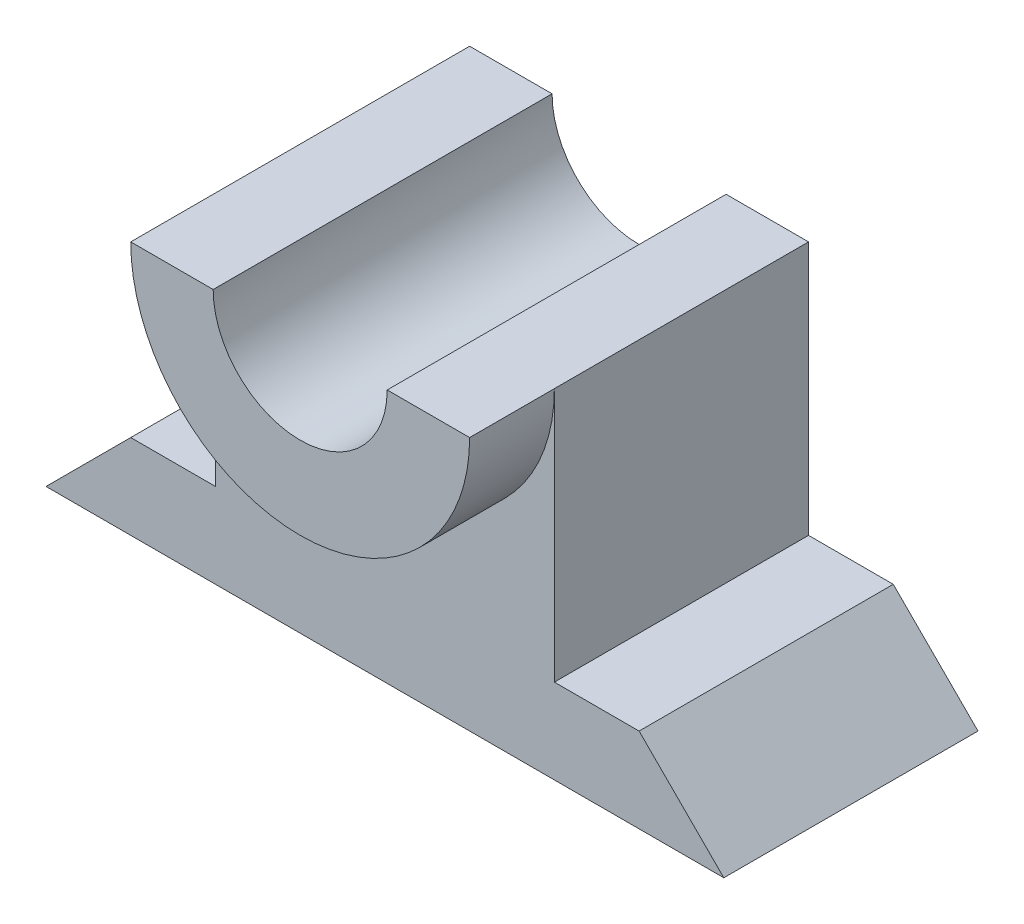
ISO-10303-21;
HEADER;
FILE_DESCRIPTION(('STEP AP214'),'2;1');
FILE_NAME('part.step','',(''),(''),'','','');
FILE_SCHEMA(('AUTOMOTIVE_DESIGN { 1 0 10303 214 1 1 1 1 }'));
ENDSEC;
DATA;
#1=APPLICATION_CONTEXT('core data for automotive mechanical design processes');
#2=APPLICATION_PROTOCOL_DEFINITION('international standard','automotive_design',2000,#1);
#3=PRODUCT_CONTEXT('',#1,'mechanical');
#4=PRODUCT('Part','Part','',(#3));
#5=PRODUCT_RELATED_PRODUCT_CATEGORY('part','',(#4));
#6=PRODUCT_DEFINITION_FORMATION('','',#4);
#7=PRODUCT_DEFINITION_CONTEXT('part definition',#1,'design');
#8=PRODUCT_DEFINITION('design','',#6,#7);
#9=PRODUCT_DEFINITION_SHAPE('','',#8);
#10=(LENGTH_UNIT() NAMED_UNIT(*) SI_UNIT(.MILLI.,.METRE.));
#11=(NAMED_UNIT(*) PLANE_ANGLE_UNIT() SI_UNIT($,.RADIAN.));
#12=(NAMED_UNIT(*) SI_UNIT($,.STERADIAN.) SOLID_ANGLE_UNIT());
#13=UNCERTAINTY_MEASURE_WITH_UNIT(LENGTH_MEASURE(1.E-05),#10,'distance_accuracy_value','');
#14=(GEOMETRIC_REPRESENTATION_CONTEXT(3) GLOBAL_UNCERTAINTY_ASSIGNED_CONTEXT((#13)) GLOBAL_UNIT_ASSIGNED_CONTEXT((#10,
#11,#12)) REPRESENTATION_CONTEXT('',''));
#15=CARTESIAN_POINT('',(0.,0.,0.));
#16=DIRECTION('',(0.,0.,1.));
#17=DIRECTION('',(1.,0.,0.));
#18=AXIS2_PLACEMENT_3D('',#15,#16,#17);
#19=CARTESIAN_POINT('',(-508.,0.,762.));
#20=DIRECTION('',(1.,0.,0.));
#21=DIRECTION('',(0.,0.,-1.));
#22=AXIS2_PLACEMENT_3D('',#19,#20,#21);
#23=PLANE('',#22);
#24=DIRECTION('',(0.,-1.,0.));
#25=VECTOR('',#24,1.);
#26=CARTESIAN_POINT('',(-508.,0.,0.));
#27=LINE('',#26,#25);
#28=CARTESIAN_POINT('',(-508.,0.,0.));
#29=VERTEX_POINT('',#28);
#30=CARTESIAN_POINT('',(-508.,-762.,0.));
#31=VERTEX_POINT('',#30);
#32=EDGE_CURVE('E133',#29,#31,#27,.T.);
#33=ORIENTED_EDGE('',*,*,#32,.T.);
#34=DIRECTION('',(0.,0.,-1.));
#35=VECTOR('',#34,1.);
#36=CARTESIAN_POINT('',(-508.,-762.,762.));
#37=LINE('',#36,#35);
#38=CARTESIAN_POINT('',(-508.,-762.,762.));
#39=VERTEX_POINT('',#38);
#40=EDGE_CURVE('E43',#39,#31,#37,.T.);
#41=ORIENTED_EDGE('',*,*,#40,.F.);
#42=DIRECTION('',(0.,-1.,0.));
#43=VECTOR('',#42,1.);
#44=CARTESIAN_POINT('',(-508.,0.,762.));
#45=LINE('',#44,#43);
#46=CARTESIAN_POINT('',(-508.,0.,762.));
#47=VERTEX_POINT('',#46);
#48=EDGE_CURVE('E92',#47,#39,#45,.T.);
#49=ORIENTED_EDGE('',*,*,#48,.F.);
#50=DIRECTION('',(0.,0.,-1.));
#51=VECTOR('',#50,1.);
#52=CARTESIAN_POINT('',(-508.,0.,762.));
#53=LINE('',#52,#51);
#54=EDGE_CURVE('E11',#47,#29,#53,.T.);
#55=ORIENTED_EDGE('',*,*,#54,.T.);
#56=EDGE_LOOP('',(#33,#41,#49,#55));
#57=FACE_BOUND('',#56,.T.);
#58=ADVANCED_FACE('F35',(#57),#23,.F.);
#59=CARTESIAN_POINT('',(2.66453525910037E-12,-761.999999999998,762.));
#60=DIRECTION('',(0.,-1.,0.));
#61=DIRECTION('',(1.,0.,0.));
#62=AXIS2_PLACEMENT_3D('',#59,#60,#61);
#63=PLANE('',#62);
#64=DIRECTION('',(-1.,0.,0.));
#65=VECTOR('',#64,1.);
#66=CARTESIAN_POINT('',(2.66453525910037E-12,-761.999999999998,0.));
#67=LINE('',#66,#65);
#68=CARTESIAN_POINT('',(-762.,-762.000000000001,0.));
#69=VERTEX_POINT('',#68);
#70=EDGE_CURVE('E135',#31,#69,#67,.T.);
#71=ORIENTED_EDGE('',*,*,#70,.T.);
#72=DIRECTION('',(0.,0.,-1.));
#73=VECTOR('',#72,1.);
#74=CARTESIAN_POINT('',(-762.,-762.000000000001,762.));
#75=LINE('',#74,#73);
#76=CARTESIAN_POINT('',(-762.,-762.000000000001,762.));
#77=VERTEX_POINT('',#76);
#78=EDGE_CURVE('E154',#77,#69,#75,.T.);
#79=ORIENTED_EDGE('',*,*,#78,.F.);
#80=DIRECTION('',(-1.,0.,0.));
#81=VECTOR('',#80,1.);
#82=CARTESIAN_POINT('',(2.66453525910037E-12,-761.999999999998,762.));
#83=LINE('',#82,#81);
#84=EDGE_CURVE('E162',#39,#77,#83,.T.);
#85=ORIENTED_EDGE('',*,*,#84,.F.);
#86=ORIENTED_EDGE('',*,*,#40,.T.);
#87=EDGE_LOOP('',(#71,#79,#85,#86));
#88=FACE_BOUND('',#87,.T.);
#89=ADVANCED_FACE('F160',(#88),#63,.F.);
#90=CARTESIAN_POINT('',(1.09906472107864E-12,-1.09906472107864E-12,762.));
#91=DIRECTION('',(0.707106781186547,-0.707106781186548,0.));
#92=DIRECTION('',(0.707106781186548,0.707106781186547,0.));
#93=AXIS2_PLACEMENT_3D('',#90,#91,#92);
#94=PLANE('',#93);
#95=DIRECTION('',(-0.707106781186548,-0.707106781186547,0.));
#96=VECTOR('',#95,1.);
#97=CARTESIAN_POINT('',(1.09906472107864E-12,-1.09906472107864E-12,0.));
#98=LINE('',#97,#96);
#99=CARTESIAN_POINT('',(-1016.,-1016.,0.));
#100=VERTEX_POINT('',#99);
#101=EDGE_CURVE('E138',#69,#100,#98,.T.);
#102=ORIENTED_EDGE('',*,*,#101,.T.);
#103=DIRECTION('',(0.,0.,-1.));
#104=VECTOR('',#103,1.);
#105=CARTESIAN_POINT('',(-1016.,-1016.,762.));
#106=LINE('',#105,#104);
#107=CARTESIAN_POINT('',(-1016.,-1016.,762.));
#108=VERTEX_POINT('',#107);
#109=EDGE_CURVE('E114',#108,#100,#106,.T.);
#110=ORIENTED_EDGE('',*,*,#109,.F.);
#111=DIRECTION('',(-0.707106781186548,-0.707106781186547,0.));
#112=VECTOR('',#111,1.);
#113=CARTESIAN_POINT('',(1.09906472107864E-12,-1.09906472107864E-12,762.));
#114=LINE('',#113,#112);
#115=EDGE_CURVE('E121',#77,#108,#114,.T.);
#116=ORIENTED_EDGE('',*,*,#115,.F.);
#117=ORIENTED_EDGE('',*,*,#78,.T.);
#118=EDGE_LOOP('',(#102,#110,#116,#117));
#119=FACE_BOUND('',#118,.T.);
#120=ADVANCED_FACE('F170',(#119),#94,.F.);
#121=CARTESIAN_POINT('',(1.11022302462516E-13,-1016.,762.));
#122=DIRECTION('',(0.,-1.,0.));
#123=DIRECTION('',(1.,0.,0.));
#124=AXIS2_PLACEMENT_3D('',#121,#122,#123);
#125=PLANE('',#124);
#126=DIRECTION('',(-1.,0.,0.));
#127=VECTOR('',#126,1.);
#128=CARTESIAN_POINT('',(1.11022302462516E-13,-1016.,0.));
#129=LINE('',#128,#127);
#130=CARTESIAN_POINT('',(1016.,-1016.,0.));
#131=VERTEX_POINT('',#130);
#132=EDGE_CURVE('E109',#131,#100,#129,.T.);
#133=ORIENTED_EDGE('',*,*,#132,.F.);
#134=DIRECTION('',(0.,0.,-1.));
#135=VECTOR('',#134,1.);
#136=CARTESIAN_POINT('',(1016.,-1016.,762.));
#137=LINE('',#136,#135);
#138=CARTESIAN_POINT('',(1016.,-1016.,762.));
#139=VERTEX_POINT('',#138);
#140=EDGE_CURVE('E104',#139,#131,#137,.T.);
#141=ORIENTED_EDGE('',*,*,#140,.F.);
#142=DIRECTION('',(-1.,0.,0.));
#143=VECTOR('',#142,1.);
#144=CARTESIAN_POINT('',(1.11022302462516E-13,-1016.,762.));
#145=LINE('',#144,#143);
#146=EDGE_CURVE('E107',#139,#108,#145,.T.);
#147=ORIENTED_EDGE('',*,*,#146,.T.);
#148=ORIENTED_EDGE('',*,*,#109,.T.);
#149=EDGE_LOOP('',(#133,#141,#147,#148));
#150=FACE_BOUND('',#149,.T.);
#151=ADVANCED_FACE('F106',(#150),#125,.T.);
#152=CARTESIAN_POINT('',(-1.17756934401283E-12,-1.17756934401283E-12,762.));
#153=DIRECTION('',(0.707106781186546,0.707106781186549,0.));
#154=DIRECTION('',(-0.707106781186549,0.707106781186546,0.));
#155=AXIS2_PLACEMENT_3D('',#152,#153,#154);
#156=PLANE('',#155);
#157=DIRECTION('',(0.707106781186549,-0.707106781186546,0.));
#158=VECTOR('',#157,1.);
#159=CARTESIAN_POINT('',(-1.17756934401283E-12,-1.17756934401283E-12,0.));
#160=LINE('',#159,#158);
#161=CARTESIAN_POINT('',(762.,-762.,0.));
#162=VERTEX_POINT('',#161);
#163=EDGE_CURVE('E142',#162,#131,#160,.T.);
#164=ORIENTED_EDGE('',*,*,#163,.F.);
#165=DIRECTION('',(0.,0.,-1.));
#166=VECTOR('',#165,1.);
#167=CARTESIAN_POINT('',(762.,-762.,762.));
#168=LINE('',#167,#166);
#169=CARTESIAN_POINT('',(762.,-762.,762.));
#170=VERTEX_POINT('',#169);
#171=EDGE_CURVE('E115',#170,#162,#168,.T.);
#172=ORIENTED_EDGE('',*,*,#171,.F.);
#173=DIRECTION('',(0.707106781186549,-0.707106781186546,0.));
#174=VECTOR('',#173,1.);
#175=CARTESIAN_POINT('',(-1.17756934401283E-12,-1.17756934401283E-12,762.));
#176=LINE('',#175,#174);
#177=EDGE_CURVE('E119',#170,#139,#176,.T.);
#178=ORIENTED_EDGE('',*,*,#177,.T.);
#179=ORIENTED_EDGE('',*,*,#140,.T.);
#180=EDGE_LOOP('',(#164,#172,#178,#179));
#181=FACE_BOUND('',#180,.T.);
#182=ADVANCED_FACE('F124',(#181),#156,.T.);
#183=CARTESIAN_POINT('',(-1.99840144432528E-12,-761.999999999998,762.));
#184=DIRECTION('',(0.,1.,0.));
#185=DIRECTION('',(-1.,0.,0.));
#186=AXIS2_PLACEMENT_3D('',#183,#184,#185);
#187=PLANE('',#186);
#188=DIRECTION('',(1.,0.,0.));
#189=VECTOR('',#188,1.);
#190=CARTESIAN_POINT('',(-1.99840144432528E-12,-761.999999999998,0.));
#191=LINE('',#190,#189);
#192=CARTESIAN_POINT('',(508.,-762.,0.));
#193=VERTEX_POINT('',#192);
#194=EDGE_CURVE('E144',#193,#162,#191,.T.);
#195=ORIENTED_EDGE('',*,*,#194,.F.);
#196=DIRECTION('',(0.,0.,-1.));
#197=VECTOR('',#196,1.);
#198=CARTESIAN_POINT('',(508.,-762.,762.));
#199=LINE('',#198,#197);
#200=CARTESIAN_POINT('',(508.,-762.,762.));
#201=VERTEX_POINT('',#200);
#202=EDGE_CURVE('E51',#201,#193,#199,.T.);
#203=ORIENTED_EDGE('',*,*,#202,.F.);
#204=DIRECTION('',(1.,0.,0.));
#205=VECTOR('',#204,1.);
#206=CARTESIAN_POINT('',(-1.99840144432528E-12,-761.999999999998,762.));
#207=LINE('',#206,#205);
#208=EDGE_CURVE('E125',#201,#170,#207,.T.);
#209=ORIENTED_EDGE('',*,*,#208,.T.);
#210=ORIENTED_EDGE('',*,*,#171,.T.);
#211=EDGE_LOOP('',(#195,#203,#209,#210));
#212=FACE_BOUND('',#211,.T.);
#213=ADVANCED_FACE('F253',(#212),#187,.T.);
#214=CARTESIAN_POINT('',(508.,0.,762.));
#215=DIRECTION('',(1.,0.,0.));
#216=DIRECTION('',(0.,0.,-1.));
#217=AXIS2_PLACEMENT_3D('',#214,#215,#216);
#218=PLANE('',#217);
#219=DIRECTION('',(0.,-1.,0.));
#220=VECTOR('',#219,1.);
#221=CARTESIAN_POINT('',(508.,0.,0.));
#222=LINE('',#221,#220);
#223=CARTESIAN_POINT('',(508.,0.,0.));
#224=VERTEX_POINT('',#223);
#225=EDGE_CURVE('E147',#224,#193,#222,.T.);
#226=ORIENTED_EDGE('',*,*,#225,.F.);
#227=DIRECTION('',(0.,0.,-1.));
#228=VECTOR('',#227,1.);
#229=CARTESIAN_POINT('',(508.,0.,762.));
#230=LINE('',#229,#228);
#231=CARTESIAN_POINT('',(508.,0.,762.));
#232=VERTEX_POINT('',#231);
#233=EDGE_CURVE('E132',#232,#224,#230,.T.);
#234=ORIENTED_EDGE('',*,*,#233,.F.);
#235=DIRECTION('',(0.,-1.,0.));
#236=VECTOR('',#235,1.);
#237=CARTESIAN_POINT('',(508.,0.,762.));
#238=LINE('',#237,#236);
#239=EDGE_CURVE('E127',#232,#201,#238,.T.);
#240=ORIENTED_EDGE('',*,*,#239,.T.);
#241=ORIENTED_EDGE('',*,*,#202,.T.);
#242=EDGE_LOOP('',(#226,#234,#240,#241));
#243=FACE_BOUND('',#242,.T.);
#244=ADVANCED_FACE('F252',(#243),#218,.T.);
#245=CARTESIAN_POINT('',(0.,0.,762.));
#246=DIRECTION('',(0.,0.,1.));
#247=DIRECTION('',(1.,0.,0.));
#248=AXIS2_PLACEMENT_3D('',#245,#246,#247);
#249=PLANE('',#248);
#250=CARTESIAN_POINT('',(0.,0.,762.));
#251=DIRECTION('',(0.,0.,1.));
#252=DIRECTION('',(1.,0.,0.));
#253=AXIS2_PLACEMENT_3D('',#250,#251,#252);
#254=CIRCLE('',#253,508.);
#255=EDGE_CURVE('E149',#47,#232,#254,.T.);
#256=ORIENTED_EDGE('',*,*,#255,.F.);
#257=ORIENTED_EDGE('',*,*,#48,.T.);
#258=ORIENTED_EDGE('',*,*,#84,.T.);
#259=ORIENTED_EDGE('',*,*,#115,.T.);
#260=ORIENTED_EDGE('',*,*,#146,.F.);
#261=ORIENTED_EDGE('',*,*,#177,.F.);
#262=ORIENTED_EDGE('',*,*,#208,.F.);
#263=ORIENTED_EDGE('',*,*,#239,.F.);
#264=EDGE_LOOP('',(#256,#257,#258,#259,#260,#261,#262,#263));
#265=FACE_BOUND('',#264,.T.);
#266=ADVANCED_FACE('F118',(#265),#249,.T.);
#267=CARTESIAN_POINT('',(0.,0.,0.));
#268=DIRECTION('',(0.,0.,1.));
#269=DIRECTION('',(1.,0.,0.));
#270=AXIS2_PLACEMENT_3D('',#267,#268,#269);
#271=PLANE('',#270);
#272=ORIENTED_EDGE('',*,*,#32,.F.);
#273=DIRECTION('',(1.,0.,0.));
#274=VECTOR('',#273,1.);
#275=CARTESIAN_POINT('',(0.,0.,0.));
#276=LINE('',#275,#274);
#277=CARTESIAN_POINT('',(-260.853189007069,0.,0.));
#278=VERTEX_POINT('',#277);
#279=EDGE_CURVE('E188',#29,#278,#276,.T.);
#280=ORIENTED_EDGE('',*,*,#279,.T.);
#281=CARTESIAN_POINT('',(0.,0.,0.));
#282=DIRECTION('',(0.,0.,1.));
#283=DIRECTION('',(1.,0.,0.));
#284=AXIS2_PLACEMENT_3D('',#281,#282,#283);
#285=CIRCLE('',#284,260.853189007069);
#286=CARTESIAN_POINT('',(260.853189007069,0.,0.));
#287=VERTEX_POINT('',#286);
#288=EDGE_CURVE('E191',#278,#287,#285,.T.);
#289=ORIENTED_EDGE('',*,*,#288,.T.);
#290=DIRECTION('',(1.,0.,0.));
#291=VECTOR('',#290,1.);
#292=CARTESIAN_POINT('',(0.,0.,0.));
#293=LINE('',#292,#291);
#294=EDGE_CURVE('E83',#287,#224,#293,.T.);
#295=ORIENTED_EDGE('',*,*,#294,.T.);
#296=ORIENTED_EDGE('',*,*,#225,.T.);
#297=ORIENTED_EDGE('',*,*,#194,.T.);
#298=ORIENTED_EDGE('',*,*,#163,.T.);
#299=ORIENTED_EDGE('',*,*,#132,.T.);
#300=ORIENTED_EDGE('',*,*,#101,.F.);
#301=ORIENTED_EDGE('',*,*,#70,.F.);
#302=EDGE_LOOP('',(#272,#280,#289,#295,#296,#297,#298,#299,#300,#301));
#303=FACE_BOUND('',#302,.T.);
#304=ADVANCED_FACE('F166',(#303),#271,.F.);
#305=CARTESIAN_POINT('',(0.,0.,1016.));
#306=DIRECTION('',(0.,0.,-1.));
#307=DIRECTION('',(-1.,0.,0.));
#308=AXIS2_PLACEMENT_3D('',#305,#306,#307);
#309=CYLINDRICAL_SURFACE('',#308,508.);
#310=ORIENTED_EDGE('',*,*,#255,.T.);
#311=DIRECTION('',(0.,0.,-1.));
#312=VECTOR('',#311,1.);
#313=CARTESIAN_POINT('',(508.,0.,1016.));
#314=LINE('',#313,#312);
#315=CARTESIAN_POINT('',(508.,0.,1016.));
#316=VERTEX_POINT('',#315);
#317=EDGE_CURVE('E136',#316,#232,#314,.T.);
#318=ORIENTED_EDGE('',*,*,#317,.F.);
#319=CARTESIAN_POINT('',(0.,0.,1016.));
#320=DIRECTION('',(0.,0.,1.));
#321=DIRECTION('',(1.,0.,0.));
#322=AXIS2_PLACEMENT_3D('',#319,#320,#321);
#323=CIRCLE('',#322,508.);
#324=CARTESIAN_POINT('',(-508.,0.,1016.));
#325=VERTEX_POINT('',#324);
#326=EDGE_CURVE('E190',#325,#316,#323,.T.);
#327=ORIENTED_EDGE('',*,*,#326,.F.);
#328=DIRECTION('',(0.,0.,-1.));
#329=VECTOR('',#328,1.);
#330=CARTESIAN_POINT('',(-508.,0.,1016.));
#331=LINE('',#330,#329);
#332=EDGE_CURVE('E184',#325,#47,#331,.T.);
#333=ORIENTED_EDGE('',*,*,#332,.T.);
#334=EDGE_LOOP('',(#310,#318,#327,#333));
#335=FACE_BOUND('',#334,.T.);
#336=ADVANCED_FACE('F215',(#335),#309,.T.);
#337=CARTESIAN_POINT('',(0.,0.,1016.));
#338=DIRECTION('',(0.,1.,0.));
#339=DIRECTION('',(-1.,0.,0.));
#340=AXIS2_PLACEMENT_3D('',#337,#338,#339);
#341=PLANE('',#340);
#342=ORIENTED_EDGE('',*,*,#294,.F.);
#343=DIRECTION('',(0.,0.,-1.));
#344=VECTOR('',#343,1.);
#345=CARTESIAN_POINT('',(260.853189007069,0.,1016.));
#346=LINE('',#345,#344);
#347=CARTESIAN_POINT('',(260.853189007069,0.,1016.));
#348=VERTEX_POINT('',#347);
#349=EDGE_CURVE('E178',#348,#287,#346,.T.);
#350=ORIENTED_EDGE('',*,*,#349,.F.);
#351=DIRECTION('',(1.,0.,0.));
#352=VECTOR('',#351,1.);
#353=CARTESIAN_POINT('',(0.,0.,1016.));
#354=LINE('',#353,#352);
#355=EDGE_CURVE('E199',#348,#316,#354,.T.);
#356=ORIENTED_EDGE('',*,*,#355,.T.);
#357=ORIENTED_EDGE('',*,*,#317,.T.);
#358=ORIENTED_EDGE('',*,*,#233,.T.);
#359=EDGE_LOOP('',(#342,#350,#356,#357,#358));
#360=FACE_BOUND('',#359,.T.);
#361=ADVANCED_FACE('F219',(#360),#341,.T.);
#362=CARTESIAN_POINT('',(0.,0.,1016.));
#363=DIRECTION('',(0.,0.,-1.));
#364=DIRECTION('',(-1.,0.,0.));
#365=AXIS2_PLACEMENT_3D('',#362,#363,#364);
#366=CYLINDRICAL_SURFACE('',#365,260.853189007069);
#367=ORIENTED_EDGE('',*,*,#288,.F.);
#368=DIRECTION('',(0.,0.,-1.));
#369=VECTOR('',#368,1.);
#370=CARTESIAN_POINT('',(-260.853189007069,0.,1016.));
#371=LINE('',#370,#369);
#372=CARTESIAN_POINT('',(-260.853189007069,0.,1016.));
#373=VERTEX_POINT('',#372);
#374=EDGE_CURVE('E181',#373,#278,#371,.T.);
#375=ORIENTED_EDGE('',*,*,#374,.F.);
#376=CARTESIAN_POINT('',(0.,0.,1016.));
#377=DIRECTION('',(0.,0.,1.));
#378=DIRECTION('',(1.,0.,0.));
#379=AXIS2_PLACEMENT_3D('',#376,#377,#378);
#380=CIRCLE('',#379,260.853189007069);
#381=EDGE_CURVE('E196',#373,#348,#380,.T.);
#382=ORIENTED_EDGE('',*,*,#381,.T.);
#383=ORIENTED_EDGE('',*,*,#349,.T.);
#384=EDGE_LOOP('',(#367,#375,#382,#383));
#385=FACE_BOUND('',#384,.T.);
#386=ADVANCED_FACE('F225',(#385),#366,.F.);
#387=CARTESIAN_POINT('',(0.,0.,1016.));
#388=DIRECTION('',(0.,1.,0.));
#389=DIRECTION('',(-1.,0.,0.));
#390=AXIS2_PLACEMENT_3D('',#387,#388,#389);
#391=PLANE('',#390);
#392=ORIENTED_EDGE('',*,*,#279,.F.);
#393=ORIENTED_EDGE('',*,*,#54,.F.);
#394=ORIENTED_EDGE('',*,*,#332,.F.);
#395=DIRECTION('',(1.,0.,0.));
#396=VECTOR('',#395,1.);
#397=CARTESIAN_POINT('',(0.,0.,1016.));
#398=LINE('',#397,#396);
#399=EDGE_CURVE('E187',#325,#373,#398,.T.);
#400=ORIENTED_EDGE('',*,*,#399,.T.);
#401=ORIENTED_EDGE('',*,*,#374,.T.);
#402=EDGE_LOOP('',(#392,#393,#394,#400,#401));
#403=FACE_BOUND('',#402,.T.);
#404=ADVANCED_FACE('F238',(#403),#391,.T.);
#405=CARTESIAN_POINT('',(0.,0.,1016.));
#406=DIRECTION('',(0.,0.,1.));
#407=DIRECTION('',(1.,0.,0.));
#408=AXIS2_PLACEMENT_3D('',#405,#406,#407);
#409=PLANE('',#408);
#410=ORIENTED_EDGE('',*,*,#326,.T.);
#411=ORIENTED_EDGE('',*,*,#355,.F.);
#412=ORIENTED_EDGE('',*,*,#381,.F.);
#413=ORIENTED_EDGE('',*,*,#399,.F.);
#414=EDGE_LOOP('',(#410,#411,#412,#413));
#415=FACE_BOUND('',#414,.T.);
#416=ADVANCED_FACE('F209',(#415),#409,.T.);
#417=CLOSED_SHELL('',(#58,#89,#120,#151,#182,#213,#244,#266,#304,#336,#361,#386,#404,#416));
#418=MANIFOLD_SOLID_BREP('B2',#417);
#419=ADVANCED_BREP_SHAPE_REPRESENTATION('',(#18,#418),#14);
#420=SHAPE_DEFINITION_REPRESENTATION(#9,#419);
ENDSEC;
END-ISO-10303-21;
